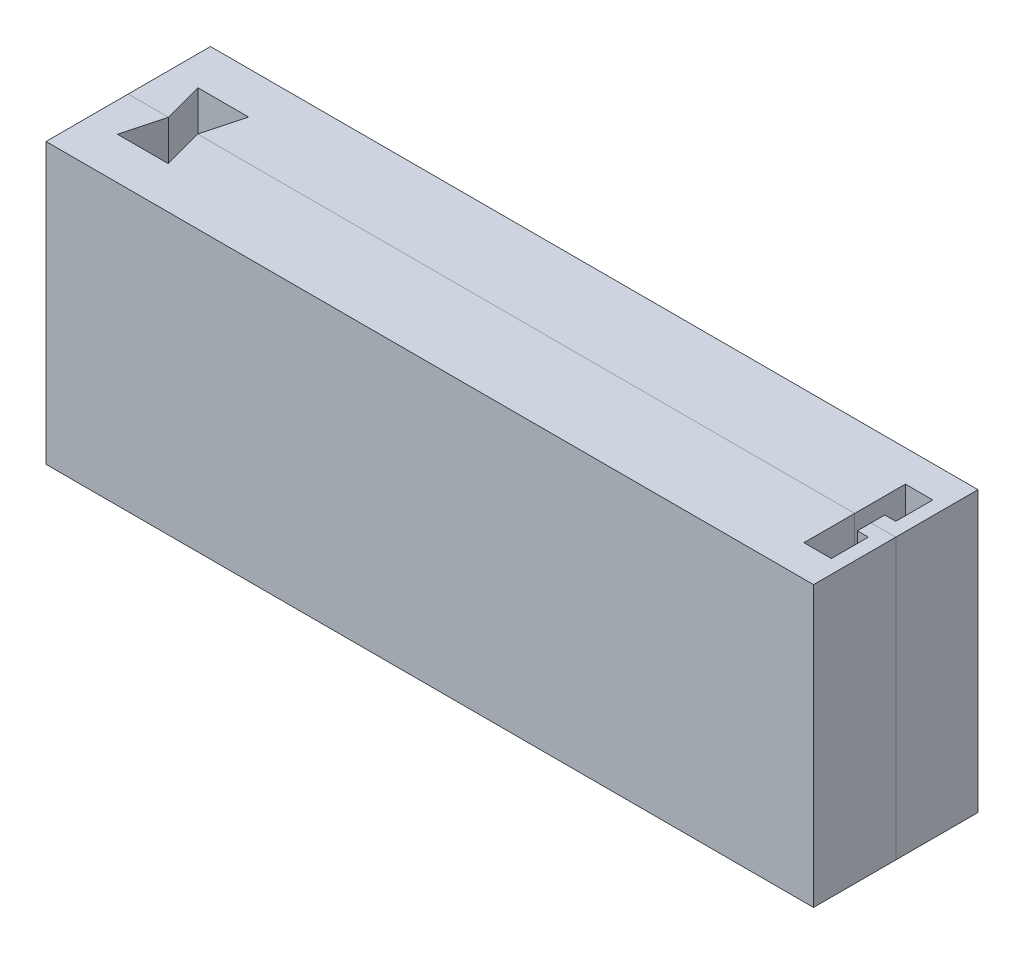
ISO-10303-21;
HEADER;
FILE_DESCRIPTION(('STEP AP214'),'2;1');
FILE_NAME('part.step','',(''),(''),'','','');
FILE_SCHEMA(('AUTOMOTIVE_DESIGN { 1 0 10303 214 1 1 1 1 }'));
ENDSEC;
DATA;
#1=APPLICATION_CONTEXT('core data for automotive mechanical design processes');
#2=APPLICATION_PROTOCOL_DEFINITION('international standard','automotive_design',2000,#1);
#3=PRODUCT_CONTEXT('',#1,'mechanical');
#4=PRODUCT('Part','Part','',(#3));
#5=PRODUCT_RELATED_PRODUCT_CATEGORY('part','',(#4));
#6=PRODUCT_DEFINITION_FORMATION('','',#4);
#7=PRODUCT_DEFINITION_CONTEXT('part definition',#1,'design');
#8=PRODUCT_DEFINITION('design','',#6,#7);
#9=PRODUCT_DEFINITION_SHAPE('','',#8);
#10=(LENGTH_UNIT() NAMED_UNIT(*) SI_UNIT(.MILLI.,.METRE.));
#11=(NAMED_UNIT(*) PLANE_ANGLE_UNIT() SI_UNIT($,.RADIAN.));
#12=(NAMED_UNIT(*) SI_UNIT($,.STERADIAN.) SOLID_ANGLE_UNIT());
#13=UNCERTAINTY_MEASURE_WITH_UNIT(LENGTH_MEASURE(1.E-05),#10,'distance_accuracy_value','');
#14=(GEOMETRIC_REPRESENTATION_CONTEXT(3) GLOBAL_UNCERTAINTY_ASSIGNED_CONTEXT((#13)) GLOBAL_UNIT_ASSIGNED_CONTEXT((#10,
#11,#12)) REPRESENTATION_CONTEXT('',''));
#15=CARTESIAN_POINT('',(0.,0.,0.));
#16=DIRECTION('',(0.,0.,1.));
#17=DIRECTION('',(1.,0.,0.));
#18=AXIS2_PLACEMENT_3D('',#15,#16,#17);
#19=CARTESIAN_POINT('',(0.,0.,0.));
#20=DIRECTION('',(0.,0.,-1.));
#21=DIRECTION('',(1.,0.,0.));
#22=AXIS2_PLACEMENT_3D('',#19,#20,#21);
#23=PLANE('',#22);
#24=DIRECTION('',(0.,1.,0.));
#25=VECTOR('',#24,1.);
#26=CARTESIAN_POINT('',(74.5633802816902,-22.387323943662,0.));
#27=LINE('',#26,#25);
#28=CARTESIAN_POINT('',(74.5633802816902,-22.387323943662,0.));
#29=VERTEX_POINT('',#28);
#30=CARTESIAN_POINT('',(74.5633802816902,28.612676056338,0.));
#31=VERTEX_POINT('',#30);
#32=EDGE_CURVE('E252',#29,#31,#27,.T.);
#33=ORIENTED_EDGE('',*,*,#32,.F.);
#34=DIRECTION('',(1.,0.,0.));
#35=VECTOR('',#34,1.);
#36=CARTESIAN_POINT('',(-60.9366197183099,-22.387323943662,0.));
#37=LINE('',#36,#35);
#38=CARTESIAN_POINT('',(79.0633802816902,-22.387323943662,0.));
#39=VERTEX_POINT('',#38);
#40=EDGE_CURVE('E281',#29,#39,#37,.T.);
#41=ORIENTED_EDGE('',*,*,#40,.T.);
#42=DIRECTION('',(0.,1.,0.));
#43=VECTOR('',#42,1.);
#44=CARTESIAN_POINT('',(79.0633802816902,28.612676056338,0.));
#45=LINE('',#44,#43);
#46=CARTESIAN_POINT('',(79.0633802816902,28.612676056338,0.));
#47=VERTEX_POINT('',#46);
#48=EDGE_CURVE('E286',#39,#47,#45,.T.);
#49=ORIENTED_EDGE('',*,*,#48,.T.);
#50=DIRECTION('',(-1.,0.,0.));
#51=VECTOR('',#50,1.);
#52=CARTESIAN_POINT('',(-60.9366197183099,28.612676056338,0.));
#53=LINE('',#52,#51);
#54=EDGE_CURVE('E266',#47,#31,#53,.T.);
#55=ORIENTED_EDGE('',*,*,#54,.T.);
#56=EDGE_LOOP('',(#33,#41,#49,#55));
#57=FACE_BOUND('',#56,.T.);
#58=ADVANCED_FACE('F55',(#57),#23,.F.);
#59=CARTESIAN_POINT('',(-60.9366197183099,28.612676056338,-15.));
#60=DIRECTION('',(1.,0.,0.));
#61=DIRECTION('',(0.,0.,1.));
#62=AXIS2_PLACEMENT_3D('',#59,#60,#61);
#63=PLANE('',#62);
#64=DIRECTION('',(0.,-1.,0.));
#65=VECTOR('',#64,1.);
#66=CARTESIAN_POINT('',(-60.9366197183099,28.612676056338,0.));
#67=LINE('',#66,#65);
#68=CARTESIAN_POINT('',(-60.9366197183099,28.612676056338,0.));
#69=VERTEX_POINT('',#68);
#70=CARTESIAN_POINT('',(-60.9366197183099,-22.387323943662,0.));
#71=VERTEX_POINT('',#70);
#72=EDGE_CURVE('E245',#69,#71,#67,.T.);
#73=ORIENTED_EDGE('',*,*,#72,.F.);
#74=DIRECTION('',(0.,0.,1.));
#75=VECTOR('',#74,1.);
#76=CARTESIAN_POINT('',(-60.9366197183099,28.612676056338,-15.));
#77=LINE('',#76,#75);
#78=CARTESIAN_POINT('',(-60.9366197183099,28.612676056338,-15.));
#79=VERTEX_POINT('',#78);
#80=EDGE_CURVE('E277',#79,#69,#77,.T.);
#81=ORIENTED_EDGE('',*,*,#80,.F.);
#82=DIRECTION('',(0.,-1.,0.));
#83=VECTOR('',#82,1.);
#84=CARTESIAN_POINT('',(-60.9366197183099,28.612676056338,-15.));
#85=LINE('',#84,#83);
#86=CARTESIAN_POINT('',(-60.9366197183099,-22.387323943662,-15.));
#87=VERTEX_POINT('',#86);
#88=EDGE_CURVE('E261',#79,#87,#85,.T.);
#89=ORIENTED_EDGE('',*,*,#88,.T.);
#90=DIRECTION('',(0.,0.,1.));
#91=VECTOR('',#90,1.);
#92=CARTESIAN_POINT('',(-60.9366197183099,-22.387323943662,-15.));
#93=LINE('',#92,#91);
#94=EDGE_CURVE('E12',#87,#71,#93,.T.);
#95=ORIENTED_EDGE('',*,*,#94,.T.);
#96=EDGE_LOOP('',(#73,#81,#89,#95));
#97=FACE_BOUND('',#96,.T.);
#98=ADVANCED_FACE('F57',(#97),#63,.F.);
#99=CARTESIAN_POINT('',(-60.9366197183099,-22.387323943662,-15.));
#100=DIRECTION('',(0.,1.,0.));
#101=DIRECTION('',(0.,0.,-1.));
#102=AXIS2_PLACEMENT_3D('',#99,#100,#101);
#103=PLANE('',#102);
#104=CARTESIAN_POINT('',(71.5633802816902,-22.387323943662,0.));
#105=VERTEX_POINT('',#104);
#106=EDGE_CURVE('E282',#71,#105,#37,.T.);
#107=ORIENTED_EDGE('',*,*,#106,.F.);
#108=ORIENTED_EDGE('',*,*,#94,.F.);
#109=DIRECTION('',(1.,0.,0.));
#110=VECTOR('',#109,1.);
#111=CARTESIAN_POINT('',(-60.9366197183099,-22.387323943662,-15.));
#112=LINE('',#111,#110);
#113=CARTESIAN_POINT('',(79.0633802816902,-22.387323943662,-15.));
#114=VERTEX_POINT('',#113);
#115=EDGE_CURVE('E265',#87,#114,#112,.T.);
#116=ORIENTED_EDGE('',*,*,#115,.T.);
#117=DIRECTION('',(0.,0.,1.));
#118=VECTOR('',#117,1.);
#119=CARTESIAN_POINT('',(79.0633802816902,-22.387323943662,-15.));
#120=LINE('',#119,#118);
#121=EDGE_CURVE('E64',#114,#39,#120,.T.);
#122=ORIENTED_EDGE('',*,*,#121,.T.);
#123=ORIENTED_EDGE('',*,*,#40,.F.);
#124=DIRECTION('',(0.,0.,-1.));
#125=VECTOR('',#124,1.);
#126=CARTESIAN_POINT('',(74.5633802816902,-22.387323943662,0.));
#127=LINE('',#126,#125);
#128=CARTESIAN_POINT('',(74.5633802816902,-22.387323943662,-2.5));
#129=VERTEX_POINT('',#128);
#130=EDGE_CURVE('E213',#29,#129,#127,.T.);
#131=ORIENTED_EDGE('',*,*,#130,.T.);
#132=DIRECTION('',(1.,0.,0.));
#133=VECTOR('',#132,1.);
#134=CARTESIAN_POINT('',(0.,-22.387323943662,-2.5));
#135=LINE('',#134,#133);
#136=CARTESIAN_POINT('',(76.5633802816902,-22.387323943662,-2.5));
#137=VERTEX_POINT('',#136);
#138=EDGE_CURVE('E208',#129,#137,#135,.T.);
#139=ORIENTED_EDGE('',*,*,#138,.T.);
#140=DIRECTION('',(0.,0.,-1.));
#141=VECTOR('',#140,1.);
#142=CARTESIAN_POINT('',(76.5633802816902,-22.387323943662,0.));
#143=LINE('',#142,#141);
#144=CARTESIAN_POINT('',(76.5633802816902,-22.387323943662,-9.25));
#145=VERTEX_POINT('',#144);
#146=EDGE_CURVE('E204',#137,#145,#143,.T.);
#147=ORIENTED_EDGE('',*,*,#146,.T.);
#148=DIRECTION('',(1.,0.,0.));
#149=VECTOR('',#148,1.);
#150=CARTESIAN_POINT('',(0.,-22.387323943662,-9.25000000000002));
#151=LINE('',#150,#149);
#152=CARTESIAN_POINT('',(71.5633802816902,-22.387323943662,-9.25));
#153=VERTEX_POINT('',#152);
#154=EDGE_CURVE('E221',#153,#145,#151,.T.);
#155=ORIENTED_EDGE('',*,*,#154,.F.);
#156=DIRECTION('',(0.,0.,-1.));
#157=VECTOR('',#156,1.);
#158=CARTESIAN_POINT('',(71.5633802816902,-22.387323943662,0.));
#159=LINE('',#158,#157);
#160=EDGE_CURVE('E217',#105,#153,#159,.T.);
#161=ORIENTED_EDGE('',*,*,#160,.F.);
#162=EDGE_LOOP('',(#107,#108,#116,#122,#123,#131,#139,#147,#155,#161));
#163=FACE_BOUND('',#162,.T.);
#164=ADVANCED_FACE('F304',(#163),#103,.F.);
#165=CARTESIAN_POINT('',(79.0633802816902,28.612676056338,-15.));
#166=DIRECTION('',(-1.,0.,0.));
#167=DIRECTION('',(0.,0.,-1.));
#168=AXIS2_PLACEMENT_3D('',#165,#166,#167);
#169=PLANE('',#168);
#170=ORIENTED_EDGE('',*,*,#48,.F.);
#171=ORIENTED_EDGE('',*,*,#121,.F.);
#172=DIRECTION('',(0.,1.,0.));
#173=VECTOR('',#172,1.);
#174=CARTESIAN_POINT('',(79.0633802816902,28.612676056338,-15.));
#175=LINE('',#174,#173);
#176=CARTESIAN_POINT('',(79.0633802816902,28.612676056338,-15.));
#177=VERTEX_POINT('',#176);
#178=EDGE_CURVE('E270',#114,#177,#175,.T.);
#179=ORIENTED_EDGE('',*,*,#178,.T.);
#180=DIRECTION('',(0.,0.,1.));
#181=VECTOR('',#180,1.);
#182=CARTESIAN_POINT('',(79.0633802816902,28.612676056338,-15.));
#183=LINE('',#182,#181);
#184=EDGE_CURVE('E297',#177,#47,#183,.T.);
#185=ORIENTED_EDGE('',*,*,#184,.T.);
#186=EDGE_LOOP('',(#170,#171,#179,#185));
#187=FACE_BOUND('',#186,.T.);
#188=ADVANCED_FACE('F309',(#187),#169,.F.);
#189=CARTESIAN_POINT('',(-60.9366197183099,28.612676056338,-15.));
#190=DIRECTION('',(0.,-1.,0.));
#191=DIRECTION('',(0.,0.,1.));
#192=AXIS2_PLACEMENT_3D('',#189,#190,#191);
#193=PLANE('',#192);
#194=CARTESIAN_POINT('',(71.5633802816902,28.612676056338,0.));
#195=VERTEX_POINT('',#194);
#196=CARTESIAN_POINT('',(-48.2866197183099,28.612676056338,0.));
#197=VERTEX_POINT('',#196);
#198=EDGE_CURVE('E293',#195,#197,#53,.T.);
#199=ORIENTED_EDGE('',*,*,#198,.F.);
#200=DIRECTION('',(0.,0.,-1.));
#201=VECTOR('',#200,1.);
#202=CARTESIAN_POINT('',(71.5633802816902,28.612676056338,0.));
#203=LINE('',#202,#201);
#204=CARTESIAN_POINT('',(71.5633802816902,28.612676056338,-9.25));
#205=VERTEX_POINT('',#204);
#206=EDGE_CURVE('E235',#195,#205,#203,.T.);
#207=ORIENTED_EDGE('',*,*,#206,.T.);
#208=DIRECTION('',(1.,0.,0.));
#209=VECTOR('',#208,1.);
#210=CARTESIAN_POINT('',(0.,28.612676056338,-9.25000000000002));
#211=LINE('',#210,#209);
#212=CARTESIAN_POINT('',(76.5633802816902,28.612676056338,-9.25));
#213=VERTEX_POINT('',#212);
#214=EDGE_CURVE('E209',#205,#213,#211,.T.);
#215=ORIENTED_EDGE('',*,*,#214,.T.);
#216=DIRECTION('',(0.,0.,-1.));
#217=VECTOR('',#216,1.);
#218=CARTESIAN_POINT('',(76.5633802816902,28.612676056338,0.));
#219=LINE('',#218,#217);
#220=CARTESIAN_POINT('',(76.5633802816902,28.612676056338,-2.5));
#221=VERTEX_POINT('',#220);
#222=EDGE_CURVE('E169',#221,#213,#219,.T.);
#223=ORIENTED_EDGE('',*,*,#222,.F.);
#224=DIRECTION('',(1.,0.,0.));
#225=VECTOR('',#224,1.);
#226=CARTESIAN_POINT('',(0.,28.612676056338,-2.5));
#227=LINE('',#226,#225);
#228=CARTESIAN_POINT('',(74.5633802816902,28.612676056338,-2.5));
#229=VERTEX_POINT('',#228);
#230=EDGE_CURVE('E229',#229,#221,#227,.T.);
#231=ORIENTED_EDGE('',*,*,#230,.F.);
#232=DIRECTION('',(0.,0.,-1.));
#233=VECTOR('',#232,1.);
#234=CARTESIAN_POINT('',(74.5633802816902,28.612676056338,0.));
#235=LINE('',#234,#233);
#236=EDGE_CURVE('E79',#31,#229,#235,.T.);
#237=ORIENTED_EDGE('',*,*,#236,.F.);
#238=ORIENTED_EDGE('',*,*,#54,.F.);
#239=ORIENTED_EDGE('',*,*,#184,.F.);
#240=DIRECTION('',(-1.,0.,0.));
#241=VECTOR('',#240,1.);
#242=CARTESIAN_POINT('',(-60.9366197183099,28.612676056338,-15.));
#243=LINE('',#242,#241);
#244=EDGE_CURVE('E274',#177,#79,#243,.T.);
#245=ORIENTED_EDGE('',*,*,#244,.T.);
#246=ORIENTED_EDGE('',*,*,#80,.T.);
#247=CARTESIAN_POINT('',(-53.5866197183098,28.612676056338,0.));
#248=VERTEX_POINT('',#247);
#249=EDGE_CURVE('E290',#248,#69,#53,.T.);
#250=ORIENTED_EDGE('',*,*,#249,.F.);
#251=DIRECTION('',(0.258819045102518,0.,0.965925826289069));
#252=VECTOR('',#251,1.);
#253=CARTESIAN_POINT('',(-53.5866197183098,28.612676056338,0.));
#254=LINE('',#253,#252);
#255=CARTESIAN_POINT('',(-55.553644461089,28.612676056338,-7.34103627979693));
#256=VERTEX_POINT('',#255);
#257=EDGE_CURVE('E184',#256,#248,#254,.T.);
#258=ORIENTED_EDGE('',*,*,#257,.F.);
#259=DIRECTION('',(-1.,0.,0.));
#260=VECTOR('',#259,1.);
#261=CARTESIAN_POINT('',(-55.553644461089,28.612676056338,-7.34103627979693));
#262=LINE('',#261,#260);
#263=CARTESIAN_POINT('',(-46.3195949755307,28.612676056338,-7.34103627979693));
#264=VERTEX_POINT('',#263);
#265=EDGE_CURVE('E164',#264,#256,#262,.T.);
#266=ORIENTED_EDGE('',*,*,#265,.F.);
#267=DIRECTION('',(0.258819045102518,0.,-0.965925826289069));
#268=VECTOR('',#267,1.);
#269=CARTESIAN_POINT('',(-46.3195949755307,28.612676056338,-7.34103627979693));
#270=LINE('',#269,#268);
#271=EDGE_CURVE('E173',#197,#264,#270,.T.);
#272=ORIENTED_EDGE('',*,*,#271,.F.);
#273=EDGE_LOOP('',(#199,#207,#215,#223,#231,#237,#238,#239,#245,#246,#250,#258,#266,#272));
#274=FACE_BOUND('',#273,.T.);
#275=ADVANCED_FACE('F181',(#274),#193,.F.);
#276=CARTESIAN_POINT('',(0.,0.,-15.));
#277=DIRECTION('',(0.,0.,-1.));
#278=DIRECTION('',(1.,0.,0.));
#279=AXIS2_PLACEMENT_3D('',#276,#277,#278);
#280=PLANE('',#279);
#281=ORIENTED_EDGE('',*,*,#88,.F.);
#282=ORIENTED_EDGE('',*,*,#244,.F.);
#283=ORIENTED_EDGE('',*,*,#178,.F.);
#284=ORIENTED_EDGE('',*,*,#115,.F.);
#285=EDGE_LOOP('',(#281,#282,#283,#284));
#286=FACE_BOUND('',#285,.T.);
#287=ADVANCED_FACE('F363',(#286),#280,.T.);
#288=ORIENTED_EDGE('',*,*,#249,.T.);
#289=ORIENTED_EDGE('',*,*,#72,.T.);
#290=ORIENTED_EDGE('',*,*,#106,.T.);
#291=DIRECTION('',(0.,1.,0.));
#292=VECTOR('',#291,1.);
#293=CARTESIAN_POINT('',(71.5633802816902,-22.387323943662,0.));
#294=LINE('',#293,#292);
#295=EDGE_CURVE('E249',#105,#195,#294,.T.);
#296=ORIENTED_EDGE('',*,*,#295,.T.);
#297=ORIENTED_EDGE('',*,*,#198,.T.);
#298=DIRECTION('',(0.,-1.,0.));
#299=VECTOR('',#298,1.);
#300=CARTESIAN_POINT('',(-48.2866197183099,215.80408878673,0.));
#301=LINE('',#300,#299);
#302=CARTESIAN_POINT('',(-48.2866197183099,2.61267605633802,0.));
#303=VERTEX_POINT('',#302);
#304=EDGE_CURVE('E170',#197,#303,#301,.T.);
#305=ORIENTED_EDGE('',*,*,#304,.T.);
#306=DIRECTION('',(-1.,0.,0.));
#307=VECTOR('',#306,1.);
#308=CARTESIAN_POINT('',(-60.9366197183099,2.61267605633802,0.));
#309=LINE('',#308,#307);
#310=CARTESIAN_POINT('',(-53.5866197183098,2.61267605633802,0.));
#311=VERTEX_POINT('',#310);
#312=EDGE_CURVE('E179',#303,#311,#309,.T.);
#313=ORIENTED_EDGE('',*,*,#312,.T.);
#314=DIRECTION('',(0.,-1.,0.));
#315=VECTOR('',#314,1.);
#316=CARTESIAN_POINT('',(-53.5866197183098,215.80408878673,0.));
#317=LINE('',#316,#315);
#318=EDGE_CURVE('E192',#248,#311,#317,.T.);
#319=ORIENTED_EDGE('',*,*,#318,.F.);
#320=EDGE_LOOP('',(#288,#289,#290,#296,#297,#305,#313,#319));
#321=FACE_BOUND('',#320,.T.);
#322=ADVANCED_FACE('F323',(#321),#23,.F.);
#323=CARTESIAN_POINT('',(76.5633802816902,-22.387323943662,0.));
#324=DIRECTION('',(-1.,0.,0.));
#325=DIRECTION('',(0.,0.,-1.));
#326=AXIS2_PLACEMENT_3D('',#323,#324,#325);
#327=PLANE('',#326);
#328=ORIENTED_EDGE('',*,*,#222,.T.);
#329=DIRECTION('',(0.,1.,0.));
#330=VECTOR('',#329,1.);
#331=CARTESIAN_POINT('',(76.5633802816902,-22.387323943662,-9.25));
#332=LINE('',#331,#330);
#333=EDGE_CURVE('E242',#145,#213,#332,.T.);
#334=ORIENTED_EDGE('',*,*,#333,.F.);
#335=ORIENTED_EDGE('',*,*,#146,.F.);
#336=DIRECTION('',(0.,1.,0.));
#337=VECTOR('',#336,1.);
#338=CARTESIAN_POINT('',(76.5633802816902,-22.387323943662,-2.5));
#339=LINE('',#338,#337);
#340=EDGE_CURVE('E225',#137,#221,#339,.T.);
#341=ORIENTED_EDGE('',*,*,#340,.T.);
#342=EDGE_LOOP('',(#328,#334,#335,#341));
#343=FACE_BOUND('',#342,.T.);
#344=ADVANCED_FACE('F341',(#343),#327,.T.);
#345=CARTESIAN_POINT('',(0.,-22.387323943662,-9.25000000000002));
#346=DIRECTION('',(0.,0.,-1.));
#347=DIRECTION('',(1.,0.,0.));
#348=AXIS2_PLACEMENT_3D('',#345,#346,#347);
#349=PLANE('',#348);
#350=ORIENTED_EDGE('',*,*,#214,.F.);
#351=DIRECTION('',(0.,1.,0.));
#352=VECTOR('',#351,1.);
#353=CARTESIAN_POINT('',(71.5633802816902,-22.387323943662,-9.25));
#354=LINE('',#353,#352);
#355=EDGE_CURVE('E246',#153,#205,#354,.T.);
#356=ORIENTED_EDGE('',*,*,#355,.F.);
#357=ORIENTED_EDGE('',*,*,#154,.T.);
#358=ORIENTED_EDGE('',*,*,#333,.T.);
#359=EDGE_LOOP('',(#350,#356,#357,#358));
#360=FACE_BOUND('',#359,.T.);
#361=ADVANCED_FACE('F338',(#360),#349,.F.);
#362=CARTESIAN_POINT('',(71.5633802816902,-22.387323943662,0.));
#363=DIRECTION('',(-1.,0.,0.));
#364=DIRECTION('',(0.,0.,-1.));
#365=AXIS2_PLACEMENT_3D('',#362,#363,#364);
#366=PLANE('',#365);
#367=ORIENTED_EDGE('',*,*,#206,.F.);
#368=ORIENTED_EDGE('',*,*,#295,.F.);
#369=ORIENTED_EDGE('',*,*,#160,.T.);
#370=ORIENTED_EDGE('',*,*,#355,.T.);
#371=EDGE_LOOP('',(#367,#368,#369,#370));
#372=FACE_BOUND('',#371,.T.);
#373=ADVANCED_FACE('F334',(#372),#366,.F.);
#374=CARTESIAN_POINT('',(74.5633802816902,-22.387323943662,0.));
#375=DIRECTION('',(-1.,0.,0.));
#376=DIRECTION('',(0.,0.,-1.));
#377=AXIS2_PLACEMENT_3D('',#374,#375,#376);
#378=PLANE('',#377);
#379=ORIENTED_EDGE('',*,*,#236,.T.);
#380=DIRECTION('',(0.,1.,0.));
#381=VECTOR('',#380,1.);
#382=CARTESIAN_POINT('',(74.5633802816902,-22.387323943662,-2.5));
#383=LINE('',#382,#381);
#384=EDGE_CURVE('E256',#129,#229,#383,.T.);
#385=ORIENTED_EDGE('',*,*,#384,.F.);
#386=ORIENTED_EDGE('',*,*,#130,.F.);
#387=ORIENTED_EDGE('',*,*,#32,.T.);
#388=EDGE_LOOP('',(#379,#385,#386,#387));
#389=FACE_BOUND('',#388,.T.);
#390=ADVANCED_FACE('F346',(#389),#378,.T.);
#391=CARTESIAN_POINT('',(0.,-22.387323943662,-2.5));
#392=DIRECTION('',(0.,0.,-1.));
#393=DIRECTION('',(1.,0.,0.));
#394=AXIS2_PLACEMENT_3D('',#391,#392,#393);
#395=PLANE('',#394);
#396=ORIENTED_EDGE('',*,*,#230,.T.);
#397=ORIENTED_EDGE('',*,*,#340,.F.);
#398=ORIENTED_EDGE('',*,*,#138,.F.);
#399=ORIENTED_EDGE('',*,*,#384,.T.);
#400=EDGE_LOOP('',(#396,#397,#398,#399));
#401=FACE_BOUND('',#400,.T.);
#402=ADVANCED_FACE('F344',(#401),#395,.T.);
#403=CARTESIAN_POINT('',(-46.3195949755307,215.80408878673,-7.34103627979693));
#404=DIRECTION('',(-0.965925826289069,0.,-0.258819045102518));
#405=DIRECTION('',(0.258819045102518,0.,-0.965925826289069));
#406=AXIS2_PLACEMENT_3D('',#403,#404,#405);
#407=PLANE('',#406);
#408=ORIENTED_EDGE('',*,*,#271,.T.);
#409=DIRECTION('',(0.,-1.,0.));
#410=VECTOR('',#409,1.);
#411=CARTESIAN_POINT('',(-46.3195949755307,215.80408878673,-7.34103627979693));
#412=LINE('',#411,#410);
#413=CARTESIAN_POINT('',(-46.3195949755307,2.61267605633802,-7.34103627979693));
#414=VERTEX_POINT('',#413);
#415=EDGE_CURVE('E159',#264,#414,#412,.T.);
#416=ORIENTED_EDGE('',*,*,#415,.T.);
#417=DIRECTION('',(0.258819045102518,0.,-0.965925826289069));
#418=VECTOR('',#417,1.);
#419=CARTESIAN_POINT('',(-46.3195949755307,2.61267605633803,-7.34103627979693));
#420=LINE('',#419,#418);
#421=EDGE_CURVE('E71',#303,#414,#420,.T.);
#422=ORIENTED_EDGE('',*,*,#421,.F.);
#423=ORIENTED_EDGE('',*,*,#304,.F.);
#424=EDGE_LOOP('',(#408,#416,#422,#423));
#425=FACE_BOUND('',#424,.T.);
#426=ADVANCED_FACE('F174',(#425),#407,.T.);
#427=CARTESIAN_POINT('',(-55.553644461089,215.80408878673,-7.34103627979693));
#428=DIRECTION('',(0.,0.,1.));
#429=DIRECTION('',(-1.,0.,0.));
#430=AXIS2_PLACEMENT_3D('',#427,#428,#429);
#431=PLANE('',#430);
#432=ORIENTED_EDGE('',*,*,#265,.T.);
#433=DIRECTION('',(0.,-1.,0.));
#434=VECTOR('',#433,1.);
#435=CARTESIAN_POINT('',(-55.553644461089,215.80408878673,-7.34103627979693));
#436=LINE('',#435,#434);
#437=CARTESIAN_POINT('',(-55.553644461089,2.61267605633802,-7.34103627979693));
#438=VERTEX_POINT('',#437);
#439=EDGE_CURVE('E196',#256,#438,#436,.T.);
#440=ORIENTED_EDGE('',*,*,#439,.T.);
#441=DIRECTION('',(-1.,0.,0.));
#442=VECTOR('',#441,1.);
#443=CARTESIAN_POINT('',(-55.553644461089,2.61267605633803,-7.34103627979693));
#444=LINE('',#443,#442);
#445=EDGE_CURVE('E167',#414,#438,#444,.T.);
#446=ORIENTED_EDGE('',*,*,#445,.F.);
#447=ORIENTED_EDGE('',*,*,#415,.F.);
#448=EDGE_LOOP('',(#432,#440,#446,#447));
#449=FACE_BOUND('',#448,.T.);
#450=ADVANCED_FACE('F161',(#449),#431,.T.);
#451=CARTESIAN_POINT('',(-53.5866197183098,215.80408878673,0.));
#452=DIRECTION('',(0.965925826289069,0.,-0.258819045102518));
#453=DIRECTION('',(0.258819045102518,0.,0.965925826289069));
#454=AXIS2_PLACEMENT_3D('',#451,#452,#453);
#455=PLANE('',#454);
#456=ORIENTED_EDGE('',*,*,#257,.T.);
#457=ORIENTED_EDGE('',*,*,#318,.T.);
#458=DIRECTION('',(0.258819045102518,0.,0.965925826289069));
#459=VECTOR('',#458,1.);
#460=CARTESIAN_POINT('',(-53.5866197183098,2.61267605633803,0.));
#461=LINE('',#460,#459);
#462=EDGE_CURVE('E188',#438,#311,#461,.T.);
#463=ORIENTED_EDGE('',*,*,#462,.F.);
#464=ORIENTED_EDGE('',*,*,#439,.F.);
#465=EDGE_LOOP('',(#456,#457,#463,#464));
#466=FACE_BOUND('',#465,.T.);
#467=ADVANCED_FACE('F321',(#466),#455,.T.);
#468=CARTESIAN_POINT('',(-60.9366197183099,2.61267605633802,-15.));
#469=DIRECTION('',(0.,-1.,0.));
#470=DIRECTION('',(0.,0.,1.));
#471=AXIS2_PLACEMENT_3D('',#468,#469,#470);
#472=PLANE('',#471);
#473=ORIENTED_EDGE('',*,*,#312,.F.);
#474=ORIENTED_EDGE('',*,*,#421,.T.);
#475=ORIENTED_EDGE('',*,*,#445,.T.);
#476=ORIENTED_EDGE('',*,*,#462,.T.);
#477=EDGE_LOOP('',(#473,#474,#475,#476));
#478=FACE_BOUND('',#477,.T.);
#479=ADVANCED_FACE('F319',(#478),#472,.F.);
#480=CLOSED_SHELL('',(#58,#98,#164,#188,#275,#287,#322,#344,#361,#373,#390,#402,#426,#450,#467,#479));
#481=MANIFOLD_SOLID_BREP('B2',#480);
#482=CARTESIAN_POINT('',(0.,0.,0.));
#483=DIRECTION('',(0.,0.,1.));
#484=DIRECTION('',(1.,0.,0.));
#485=AXIS2_PLACEMENT_3D('',#482,#483,#484);
#486=PLANE('',#485);
#487=DIRECTION('',(0.,1.,0.));
#488=VECTOR('',#487,1.);
#489=CARTESIAN_POINT('',(74.5633802816902,-22.387323943662,0.));
#490=LINE('',#489,#488);
#491=CARTESIAN_POINT('',(74.5633802816902,-22.387323943662,0.));
#492=VERTEX_POINT('',#491);
#493=CARTESIAN_POINT('',(74.5633802816902,28.612676056338,0.));
#494=VERTEX_POINT('',#493);
#495=EDGE_CURVE('E683',#492,#494,#490,.T.);
#496=ORIENTED_EDGE('',*,*,#495,.T.);
#497=DIRECTION('',(-1.,0.,0.));
#498=VECTOR('',#497,1.);
#499=CARTESIAN_POINT('',(-60.9366197183099,28.612676056338,0.));
#500=LINE('',#499,#498);
#501=CARTESIAN_POINT('',(79.0633802816902,28.612676056338,0.));
#502=VERTEX_POINT('',#501);
#503=EDGE_CURVE('E692',#502,#494,#500,.T.);
#504=ORIENTED_EDGE('',*,*,#503,.F.);
#505=DIRECTION('',(0.,1.,0.));
#506=VECTOR('',#505,1.);
#507=CARTESIAN_POINT('',(79.0633802816902,28.612676056338,0.));
#508=LINE('',#507,#506);
#509=CARTESIAN_POINT('',(79.0633802816902,-22.387323943662,0.));
#510=VERTEX_POINT('',#509);
#511=EDGE_CURVE('E704',#510,#502,#508,.T.);
#512=ORIENTED_EDGE('',*,*,#511,.F.);
#513=DIRECTION('',(1.,0.,0.));
#514=VECTOR('',#513,1.);
#515=CARTESIAN_POINT('',(-60.9366197183099,-22.387323943662,0.));
#516=LINE('',#515,#514);
#517=EDGE_CURVE('E700',#492,#510,#516,.T.);
#518=ORIENTED_EDGE('',*,*,#517,.F.);
#519=EDGE_LOOP('',(#496,#504,#512,#518));
#520=FACE_BOUND('',#519,.T.);
#521=ADVANCED_FACE('F512',(#520),#486,.F.);
#522=CARTESIAN_POINT('',(-60.9366197183099,28.612676056338,15.));
#523=DIRECTION('',(1.,0.,0.));
#524=DIRECTION('',(0.,0.,-1.));
#525=AXIS2_PLACEMENT_3D('',#522,#523,#524);
#526=PLANE('',#525);
#527=DIRECTION('',(0.,-1.,0.));
#528=VECTOR('',#527,1.);
#529=CARTESIAN_POINT('',(-60.9366197183099,28.612676056338,0.));
#530=LINE('',#529,#528);
#531=CARTESIAN_POINT('',(-60.9366197183099,28.612676056338,0.));
#532=VERTEX_POINT('',#531);
#533=CARTESIAN_POINT('',(-60.9366197183099,-22.387323943662,0.));
#534=VERTEX_POINT('',#533);
#535=EDGE_CURVE('E678',#532,#534,#530,.T.);
#536=ORIENTED_EDGE('',*,*,#535,.T.);
#537=DIRECTION('',(0.,0.,-1.));
#538=VECTOR('',#537,1.);
#539=CARTESIAN_POINT('',(-60.9366197183099,-22.387323943662,15.));
#540=LINE('',#539,#538);
#541=CARTESIAN_POINT('',(-60.9366197183099,-22.387323943662,15.));
#542=VERTEX_POINT('',#541);
#543=EDGE_CURVE('E53',#542,#534,#540,.T.);
#544=ORIENTED_EDGE('',*,*,#543,.F.);
#545=DIRECTION('',(0.,-1.,0.));
#546=VECTOR('',#545,1.);
#547=CARTESIAN_POINT('',(-60.9366197183099,28.612676056338,15.));
#548=LINE('',#547,#546);
#549=CARTESIAN_POINT('',(-60.9366197183099,28.612676056338,15.));
#550=VERTEX_POINT('',#549);
#551=EDGE_CURVE('E688',#550,#542,#548,.T.);
#552=ORIENTED_EDGE('',*,*,#551,.F.);
#553=DIRECTION('',(0.,0.,-1.));
#554=VECTOR('',#553,1.);
#555=CARTESIAN_POINT('',(-60.9366197183099,28.612676056338,15.));
#556=LINE('',#555,#554);
#557=EDGE_CURVE('E698',#550,#532,#556,.T.);
#558=ORIENTED_EDGE('',*,*,#557,.T.);
#559=EDGE_LOOP('',(#536,#544,#552,#558));
#560=FACE_BOUND('',#559,.T.);
#561=ADVANCED_FACE('F514',(#560),#526,.F.);
#562=CARTESIAN_POINT('',(-60.9366197183099,-22.387323943662,15.));
#563=DIRECTION('',(0.,1.,0.));
#564=DIRECTION('',(0.,0.,1.));
#565=AXIS2_PLACEMENT_3D('',#562,#563,#564);
#566=PLANE('',#565);
#567=CARTESIAN_POINT('',(71.5633802816902,-22.387323943662,0.));
#568=VERTEX_POINT('',#567);
#569=EDGE_CURVE('E701',#534,#568,#516,.T.);
#570=ORIENTED_EDGE('',*,*,#569,.T.);
#571=DIRECTION('',(0.,0.,1.));
#572=VECTOR('',#571,1.);
#573=CARTESIAN_POINT('',(71.5633802816902,-22.387323943662,0.));
#574=LINE('',#573,#572);
#575=CARTESIAN_POINT('',(71.5633802816902,-22.387323943662,9.25));
#576=VERTEX_POINT('',#575);
#577=EDGE_CURVE('E658',#568,#576,#574,.T.);
#578=ORIENTED_EDGE('',*,*,#577,.T.);
#579=DIRECTION('',(1.,0.,0.));
#580=VECTOR('',#579,1.);
#581=CARTESIAN_POINT('',(0.,-22.387323943662,9.25000000000002));
#582=LINE('',#581,#580);
#583=CARTESIAN_POINT('',(76.5633802816902,-22.387323943662,9.25));
#584=VERTEX_POINT('',#583);
#585=EDGE_CURVE('E661',#576,#584,#582,.T.);
#586=ORIENTED_EDGE('',*,*,#585,.T.);
#587=DIRECTION('',(0.,0.,1.));
#588=VECTOR('',#587,1.);
#589=CARTESIAN_POINT('',(76.5633802816902,-22.387323943662,0.));
#590=LINE('',#589,#588);
#591=CARTESIAN_POINT('',(76.5633802816902,-22.387323943662,2.5));
#592=VERTEX_POINT('',#591);
#593=EDGE_CURVE('E651',#592,#584,#590,.T.);
#594=ORIENTED_EDGE('',*,*,#593,.F.);
#595=DIRECTION('',(1.,0.,0.));
#596=VECTOR('',#595,1.);
#597=CARTESIAN_POINT('',(0.,-22.387323943662,2.5));
#598=LINE('',#597,#596);
#599=CARTESIAN_POINT('',(74.5633802816902,-22.387323943662,2.5));
#600=VERTEX_POINT('',#599);
#601=EDGE_CURVE('E653',#600,#592,#598,.T.);
#602=ORIENTED_EDGE('',*,*,#601,.F.);
#603=DIRECTION('',(0.,0.,1.));
#604=VECTOR('',#603,1.);
#605=CARTESIAN_POINT('',(74.5633802816902,-22.387323943662,0.));
#606=LINE('',#605,#604);
#607=EDGE_CURVE('E656',#492,#600,#606,.T.);
#608=ORIENTED_EDGE('',*,*,#607,.F.);
#609=ORIENTED_EDGE('',*,*,#517,.T.);
#610=DIRECTION('',(0.,0.,-1.));
#611=VECTOR('',#610,1.);
#612=CARTESIAN_POINT('',(79.0633802816902,-22.387323943662,15.));
#613=LINE('',#612,#611);
#614=CARTESIAN_POINT('',(79.0633802816902,-22.387323943662,15.));
#615=VERTEX_POINT('',#614);
#616=EDGE_CURVE('E520',#615,#510,#613,.T.);
#617=ORIENTED_EDGE('',*,*,#616,.F.);
#618=DIRECTION('',(1.,0.,0.));
#619=VECTOR('',#618,1.);
#620=CARTESIAN_POINT('',(-60.9366197183099,-22.387323943662,15.));
#621=LINE('',#620,#619);
#622=EDGE_CURVE('E691',#542,#615,#621,.T.);
#623=ORIENTED_EDGE('',*,*,#622,.F.);
#624=ORIENTED_EDGE('',*,*,#543,.T.);
#625=EDGE_LOOP('',(#570,#578,#586,#594,#602,#608,#609,#617,#623,#624));
#626=FACE_BOUND('',#625,.T.);
#627=ADVANCED_FACE('F730',(#626),#566,.F.);
#628=CARTESIAN_POINT('',(79.0633802816902,28.612676056338,15.));
#629=DIRECTION('',(-1.,0.,0.));
#630=DIRECTION('',(0.,0.,1.));
#631=AXIS2_PLACEMENT_3D('',#628,#629,#630);
#632=PLANE('',#631);
#633=ORIENTED_EDGE('',*,*,#511,.T.);
#634=DIRECTION('',(0.,0.,-1.));
#635=VECTOR('',#634,1.);
#636=CARTESIAN_POINT('',(79.0633802816902,28.612676056338,15.));
#637=LINE('',#636,#635);
#638=CARTESIAN_POINT('',(79.0633802816902,28.612676056338,15.));
#639=VERTEX_POINT('',#638);
#640=EDGE_CURVE('E711',#639,#502,#637,.T.);
#641=ORIENTED_EDGE('',*,*,#640,.F.);
#642=DIRECTION('',(0.,1.,0.));
#643=VECTOR('',#642,1.);
#644=CARTESIAN_POINT('',(79.0633802816902,28.612676056338,15.));
#645=LINE('',#644,#643);
#646=EDGE_CURVE('E694',#615,#639,#645,.T.);
#647=ORIENTED_EDGE('',*,*,#646,.F.);
#648=ORIENTED_EDGE('',*,*,#616,.T.);
#649=EDGE_LOOP('',(#633,#641,#647,#648));
#650=FACE_BOUND('',#649,.T.);
#651=ADVANCED_FACE('F718',(#650),#632,.F.);
#652=CARTESIAN_POINT('',(-60.9366197183099,28.612676056338,15.));
#653=DIRECTION('',(0.,-1.,0.));
#654=DIRECTION('',(0.,0.,-1.));
#655=AXIS2_PLACEMENT_3D('',#652,#653,#654);
#656=PLANE('',#655);
#657=CARTESIAN_POINT('',(71.5633802816902,28.612676056338,0.));
#658=VERTEX_POINT('',#657);
#659=CARTESIAN_POINT('',(-48.2866197183099,28.612676056338,0.));
#660=VERTEX_POINT('',#659);
#661=EDGE_CURVE('E636',#658,#660,#500,.T.);
#662=ORIENTED_EDGE('',*,*,#661,.T.);
#663=DIRECTION('',(0.258819045102518,0.,0.965925826289069));
#664=VECTOR('',#663,1.);
#665=CARTESIAN_POINT('',(-46.3195949755307,28.612676056338,7.34103627979693));
#666=LINE('',#665,#664);
#667=CARTESIAN_POINT('',(-46.3195949755307,28.612676056338,7.34103627979693));
#668=VERTEX_POINT('',#667);
#669=EDGE_CURVE('E626',#660,#668,#666,.T.);
#670=ORIENTED_EDGE('',*,*,#669,.T.);
#671=DIRECTION('',(-1.,0.,0.));
#672=VECTOR('',#671,1.);
#673=CARTESIAN_POINT('',(-55.553644461089,28.612676056338,7.34103627979693));
#674=LINE('',#673,#672);
#675=CARTESIAN_POINT('',(-55.553644461089,28.612676056338,7.34103627979693));
#676=VERTEX_POINT('',#675);
#677=EDGE_CURVE('E615',#668,#676,#674,.T.);
#678=ORIENTED_EDGE('',*,*,#677,.T.);
#679=DIRECTION('',(0.258819045102518,0.,-0.965925826289069));
#680=VECTOR('',#679,1.);
#681=CARTESIAN_POINT('',(-53.5866197183098,28.612676056338,0.));
#682=LINE('',#681,#680);
#683=CARTESIAN_POINT('',(-53.5866197183098,28.612676056338,0.));
#684=VERTEX_POINT('',#683);
#685=EDGE_CURVE('E625',#676,#684,#682,.T.);
#686=ORIENTED_EDGE('',*,*,#685,.T.);
#687=EDGE_CURVE('E706',#684,#532,#500,.T.);
#688=ORIENTED_EDGE('',*,*,#687,.T.);
#689=ORIENTED_EDGE('',*,*,#557,.F.);
#690=DIRECTION('',(-1.,0.,0.));
#691=VECTOR('',#690,1.);
#692=CARTESIAN_POINT('',(-60.9366197183099,28.612676056338,15.));
#693=LINE('',#692,#691);
#694=EDGE_CURVE('E696',#639,#550,#693,.T.);
#695=ORIENTED_EDGE('',*,*,#694,.F.);
#696=ORIENTED_EDGE('',*,*,#640,.T.);
#697=ORIENTED_EDGE('',*,*,#503,.T.);
#698=DIRECTION('',(0.,0.,1.));
#699=VECTOR('',#698,1.);
#700=CARTESIAN_POINT('',(74.5633802816902,28.612676056338,0.));
#701=LINE('',#700,#699);
#702=CARTESIAN_POINT('',(74.5633802816902,28.612676056338,2.5));
#703=VERTEX_POINT('',#702);
#704=EDGE_CURVE('E535',#494,#703,#701,.T.);
#705=ORIENTED_EDGE('',*,*,#704,.T.);
#706=DIRECTION('',(1.,0.,0.));
#707=VECTOR('',#706,1.);
#708=CARTESIAN_POINT('',(0.,28.612676056338,2.5));
#709=LINE('',#708,#707);
#710=CARTESIAN_POINT('',(76.5633802816902,28.612676056338,2.5));
#711=VERTEX_POINT('',#710);
#712=EDGE_CURVE('E667',#703,#711,#709,.T.);
#713=ORIENTED_EDGE('',*,*,#712,.T.);
#714=DIRECTION('',(0.,0.,1.));
#715=VECTOR('',#714,1.);
#716=CARTESIAN_POINT('',(76.5633802816902,28.612676056338,0.));
#717=LINE('',#716,#715);
#718=CARTESIAN_POINT('',(76.5633802816902,28.612676056338,9.25));
#719=VERTEX_POINT('',#718);
#720=EDGE_CURVE('E630',#711,#719,#717,.T.);
#721=ORIENTED_EDGE('',*,*,#720,.T.);
#722=DIRECTION('',(1.,0.,0.));
#723=VECTOR('',#722,1.);
#724=CARTESIAN_POINT('',(0.,28.612676056338,9.25000000000002));
#725=LINE('',#724,#723);
#726=CARTESIAN_POINT('',(71.5633802816902,28.612676056338,9.25));
#727=VERTEX_POINT('',#726);
#728=EDGE_CURVE('E654',#727,#719,#725,.T.);
#729=ORIENTED_EDGE('',*,*,#728,.F.);
#730=DIRECTION('',(0.,0.,1.));
#731=VECTOR('',#730,1.);
#732=CARTESIAN_POINT('',(71.5633802816902,28.612676056338,0.));
#733=LINE('',#732,#731);
#734=EDGE_CURVE('E671',#658,#727,#733,.T.);
#735=ORIENTED_EDGE('',*,*,#734,.F.);
#736=EDGE_LOOP('',(#662,#670,#678,#686,#688,#689,#695,#696,#697,#705,#713,#721,#729,#735));
#737=FACE_BOUND('',#736,.T.);
#738=ADVANCED_FACE('F633',(#737),#656,.F.);
#739=CARTESIAN_POINT('',(0.,0.,15.));
#740=DIRECTION('',(0.,0.,1.));
#741=DIRECTION('',(1.,0.,0.));
#742=AXIS2_PLACEMENT_3D('',#739,#740,#741);
#743=PLANE('',#742);
#744=ORIENTED_EDGE('',*,*,#551,.T.);
#745=ORIENTED_EDGE('',*,*,#622,.T.);
#746=ORIENTED_EDGE('',*,*,#646,.T.);
#747=ORIENTED_EDGE('',*,*,#694,.T.);
#748=EDGE_LOOP('',(#744,#745,#746,#747));
#749=FACE_BOUND('',#748,.T.);
#750=ADVANCED_FACE('F728',(#749),#743,.T.);
#751=ORIENTED_EDGE('',*,*,#687,.F.);
#752=DIRECTION('',(0.,-1.,0.));
#753=VECTOR('',#752,1.);
#754=CARTESIAN_POINT('',(-53.5866197183098,215.80408878673,0.));
#755=LINE('',#754,#753);
#756=CARTESIAN_POINT('',(-53.5866197183098,2.61267605633802,0.));
#757=VERTEX_POINT('',#756);
#758=EDGE_CURVE('E646',#684,#757,#755,.T.);
#759=ORIENTED_EDGE('',*,*,#758,.T.);
#760=DIRECTION('',(-1.,0.,0.));
#761=VECTOR('',#760,1.);
#762=CARTESIAN_POINT('',(-60.9366197183099,2.61267605633802,0.));
#763=LINE('',#762,#761);
#764=CARTESIAN_POINT('',(-48.2866197183099,2.61267605633802,0.));
#765=VERTEX_POINT('',#764);
#766=EDGE_CURVE('E637',#765,#757,#763,.T.);
#767=ORIENTED_EDGE('',*,*,#766,.F.);
#768=DIRECTION('',(0.,-1.,0.));
#769=VECTOR('',#768,1.);
#770=CARTESIAN_POINT('',(-48.2866197183099,215.80408878673,0.));
#771=LINE('',#770,#769);
#772=EDGE_CURVE('E527',#660,#765,#771,.T.);
#773=ORIENTED_EDGE('',*,*,#772,.F.);
#774=ORIENTED_EDGE('',*,*,#661,.F.);
#775=DIRECTION('',(0.,1.,0.));
#776=VECTOR('',#775,1.);
#777=CARTESIAN_POINT('',(71.5633802816902,-22.387323943662,0.));
#778=LINE('',#777,#776);
#779=EDGE_CURVE('E681',#568,#658,#778,.T.);
#780=ORIENTED_EDGE('',*,*,#779,.F.);
#781=ORIENTED_EDGE('',*,*,#569,.F.);
#782=ORIENTED_EDGE('',*,*,#535,.F.);
#783=EDGE_LOOP('',(#751,#759,#767,#773,#774,#780,#781,#782));
#784=FACE_BOUND('',#783,.T.);
#785=ADVANCED_FACE('F737',(#784),#486,.F.);
#786=CARTESIAN_POINT('',(76.5633802816902,-22.387323943662,0.));
#787=DIRECTION('',(-1.,0.,0.));
#788=DIRECTION('',(0.,0.,1.));
#789=AXIS2_PLACEMENT_3D('',#786,#787,#788);
#790=PLANE('',#789);
#791=ORIENTED_EDGE('',*,*,#720,.F.);
#792=DIRECTION('',(0.,1.,0.));
#793=VECTOR('',#792,1.);
#794=CARTESIAN_POINT('',(76.5633802816902,-22.387323943662,2.5));
#795=LINE('',#794,#793);
#796=EDGE_CURVE('E664',#592,#711,#795,.T.);
#797=ORIENTED_EDGE('',*,*,#796,.F.);
#798=ORIENTED_EDGE('',*,*,#593,.T.);
#799=DIRECTION('',(0.,1.,0.));
#800=VECTOR('',#799,1.);
#801=CARTESIAN_POINT('',(76.5633802816902,-22.387323943662,9.25));
#802=LINE('',#801,#800);
#803=EDGE_CURVE('E676',#584,#719,#802,.T.);
#804=ORIENTED_EDGE('',*,*,#803,.T.);
#805=EDGE_LOOP('',(#791,#797,#798,#804));
#806=FACE_BOUND('',#805,.T.);
#807=ADVANCED_FACE('F751',(#806),#790,.T.);
#808=CARTESIAN_POINT('',(0.,-22.387323943662,9.25000000000002));
#809=DIRECTION('',(0.,0.,1.));
#810=DIRECTION('',(1.,0.,0.));
#811=AXIS2_PLACEMENT_3D('',#808,#809,#810);
#812=PLANE('',#811);
#813=ORIENTED_EDGE('',*,*,#728,.T.);
#814=ORIENTED_EDGE('',*,*,#803,.F.);
#815=ORIENTED_EDGE('',*,*,#585,.F.);
#816=DIRECTION('',(0.,1.,0.));
#817=VECTOR('',#816,1.);
#818=CARTESIAN_POINT('',(71.5633802816902,-22.387323943662,9.25));
#819=LINE('',#818,#817);
#820=EDGE_CURVE('E679',#576,#727,#819,.T.);
#821=ORIENTED_EDGE('',*,*,#820,.T.);
#822=EDGE_LOOP('',(#813,#814,#815,#821));
#823=FACE_BOUND('',#822,.T.);
#824=ADVANCED_FACE('F744',(#823),#812,.F.);
#825=CARTESIAN_POINT('',(71.5633802816902,-22.387323943662,0.));
#826=DIRECTION('',(-1.,0.,0.));
#827=DIRECTION('',(0.,0.,1.));
#828=AXIS2_PLACEMENT_3D('',#825,#826,#827);
#829=PLANE('',#828);
#830=ORIENTED_EDGE('',*,*,#734,.T.);
#831=ORIENTED_EDGE('',*,*,#820,.F.);
#832=ORIENTED_EDGE('',*,*,#577,.F.);
#833=ORIENTED_EDGE('',*,*,#779,.T.);
#834=EDGE_LOOP('',(#830,#831,#832,#833));
#835=FACE_BOUND('',#834,.T.);
#836=ADVANCED_FACE('F739',(#835),#829,.F.);
#837=CARTESIAN_POINT('',(74.5633802816902,-22.387323943662,0.));
#838=DIRECTION('',(-1.,0.,0.));
#839=DIRECTION('',(0.,0.,1.));
#840=AXIS2_PLACEMENT_3D('',#837,#838,#839);
#841=PLANE('',#840);
#842=ORIENTED_EDGE('',*,*,#704,.F.);
#843=ORIENTED_EDGE('',*,*,#495,.F.);
#844=ORIENTED_EDGE('',*,*,#607,.T.);
#845=DIRECTION('',(0.,1.,0.));
#846=VECTOR('',#845,1.);
#847=CARTESIAN_POINT('',(74.5633802816902,-22.387323943662,2.5));
#848=LINE('',#847,#846);
#849=EDGE_CURVE('E685',#600,#703,#848,.T.);
#850=ORIENTED_EDGE('',*,*,#849,.T.);
#851=EDGE_LOOP('',(#842,#843,#844,#850));
#852=FACE_BOUND('',#851,.T.);
#853=ADVANCED_FACE('F756',(#852),#841,.T.);
#854=CARTESIAN_POINT('',(0.,-22.387323943662,2.5));
#855=DIRECTION('',(0.,0.,1.));
#856=DIRECTION('',(1.,0.,0.));
#857=AXIS2_PLACEMENT_3D('',#854,#855,#856);
#858=PLANE('',#857);
#859=ORIENTED_EDGE('',*,*,#712,.F.);
#860=ORIENTED_EDGE('',*,*,#849,.F.);
#861=ORIENTED_EDGE('',*,*,#601,.T.);
#862=ORIENTED_EDGE('',*,*,#796,.T.);
#863=EDGE_LOOP('',(#859,#860,#861,#862));
#864=FACE_BOUND('',#863,.T.);
#865=ADVANCED_FACE('F754',(#864),#858,.T.);
#866=CARTESIAN_POINT('',(-46.3195949755307,215.80408878673,7.34103627979693));
#867=DIRECTION('',(-0.965925826289069,0.,0.258819045102518));
#868=DIRECTION('',(0.258819045102518,0.,0.965925826289069));
#869=AXIS2_PLACEMENT_3D('',#866,#867,#868);
#870=PLANE('',#869);
#871=ORIENTED_EDGE('',*,*,#669,.F.);
#872=ORIENTED_EDGE('',*,*,#772,.T.);
#873=DIRECTION('',(0.258819045102518,0.,0.965925826289069));
#874=VECTOR('',#873,1.);
#875=CARTESIAN_POINT('',(-46.3195949755307,2.61267605633803,7.34103627979693));
#876=LINE('',#875,#874);
#877=CARTESIAN_POINT('',(-46.3195949755307,2.61267605633802,7.34103627979693));
#878=VERTEX_POINT('',#877);
#879=EDGE_CURVE('E629',#765,#878,#876,.T.);
#880=ORIENTED_EDGE('',*,*,#879,.T.);
#881=DIRECTION('',(0.,-1.,0.));
#882=VECTOR('',#881,1.);
#883=CARTESIAN_POINT('',(-46.3195949755307,215.80408878673,7.34103627979693));
#884=LINE('',#883,#882);
#885=EDGE_CURVE('E619',#668,#878,#884,.T.);
#886=ORIENTED_EDGE('',*,*,#885,.F.);
#887=EDGE_LOOP('',(#871,#872,#880,#886));
#888=FACE_BOUND('',#887,.T.);
#889=ADVANCED_FACE('F628',(#888),#870,.T.);
#890=CARTESIAN_POINT('',(-55.553644461089,215.80408878673,7.34103627979693));
#891=DIRECTION('',(0.,0.,-1.));
#892=DIRECTION('',(-1.,0.,0.));
#893=AXIS2_PLACEMENT_3D('',#890,#891,#892);
#894=PLANE('',#893);
#895=ORIENTED_EDGE('',*,*,#677,.F.);
#896=ORIENTED_EDGE('',*,*,#885,.T.);
#897=DIRECTION('',(-1.,0.,0.));
#898=VECTOR('',#897,1.);
#899=CARTESIAN_POINT('',(-55.553644461089,2.61267605633803,7.34103627979693));
#900=LINE('',#899,#898);
#901=CARTESIAN_POINT('',(-55.553644461089,2.61267605633802,7.34103627979693));
#902=VERTEX_POINT('',#901);
#903=EDGE_CURVE('E641',#878,#902,#900,.T.);
#904=ORIENTED_EDGE('',*,*,#903,.T.);
#905=DIRECTION('',(0.,-1.,0.));
#906=VECTOR('',#905,1.);
#907=CARTESIAN_POINT('',(-55.553644461089,215.80408878673,7.34103627979693));
#908=LINE('',#907,#906);
#909=EDGE_CURVE('E621',#676,#902,#908,.T.);
#910=ORIENTED_EDGE('',*,*,#909,.F.);
#911=EDGE_LOOP('',(#895,#896,#904,#910));
#912=FACE_BOUND('',#911,.T.);
#913=ADVANCED_FACE('F617',(#912),#894,.T.);
#914=CARTESIAN_POINT('',(-53.5866197183098,215.80408878673,0.));
#915=DIRECTION('',(0.965925826289069,0.,0.258819045102518));
#916=DIRECTION('',(0.258819045102518,0.,-0.965925826289069));
#917=AXIS2_PLACEMENT_3D('',#914,#915,#916);
#918=PLANE('',#917);
#919=ORIENTED_EDGE('',*,*,#685,.F.);
#920=ORIENTED_EDGE('',*,*,#909,.T.);
#921=DIRECTION('',(0.258819045102518,0.,-0.965925826289069));
#922=VECTOR('',#921,1.);
#923=CARTESIAN_POINT('',(-53.5866197183098,2.61267605633803,0.));
#924=LINE('',#923,#922);
#925=EDGE_CURVE('E645',#902,#757,#924,.T.);
#926=ORIENTED_EDGE('',*,*,#925,.T.);
#927=ORIENTED_EDGE('',*,*,#758,.F.);
#928=EDGE_LOOP('',(#919,#920,#926,#927));
#929=FACE_BOUND('',#928,.T.);
#930=ADVANCED_FACE('F858',(#929),#918,.T.);
#931=CARTESIAN_POINT('',(-60.9366197183099,2.61267605633802,15.));
#932=DIRECTION('',(0.,-1.,0.));
#933=DIRECTION('',(0.,0.,-1.));
#934=AXIS2_PLACEMENT_3D('',#931,#932,#933);
#935=PLANE('',#934);
#936=ORIENTED_EDGE('',*,*,#766,.T.);
#937=ORIENTED_EDGE('',*,*,#925,.F.);
#938=ORIENTED_EDGE('',*,*,#903,.F.);
#939=ORIENTED_EDGE('',*,*,#879,.F.);
#940=EDGE_LOOP('',(#936,#937,#938,#939));
#941=FACE_BOUND('',#940,.T.);
#942=ADVANCED_FACE('F867',(#941),#935,.F.);
#943=CLOSED_SHELL('',(#521,#561,#627,#651,#738,#750,#785,#807,#824,#836,#853,#865,#889,#913,
#930,#942));
#944=MANIFOLD_SOLID_BREP('B6_NOT_SHOWN',#943);
#945=ADVANCED_BREP_SHAPE_REPRESENTATION('',(#18,#481,#944),#14);
#946=SHAPE_DEFINITION_REPRESENTATION(#9,#945);
ENDSEC;
END-ISO-10303-21;
